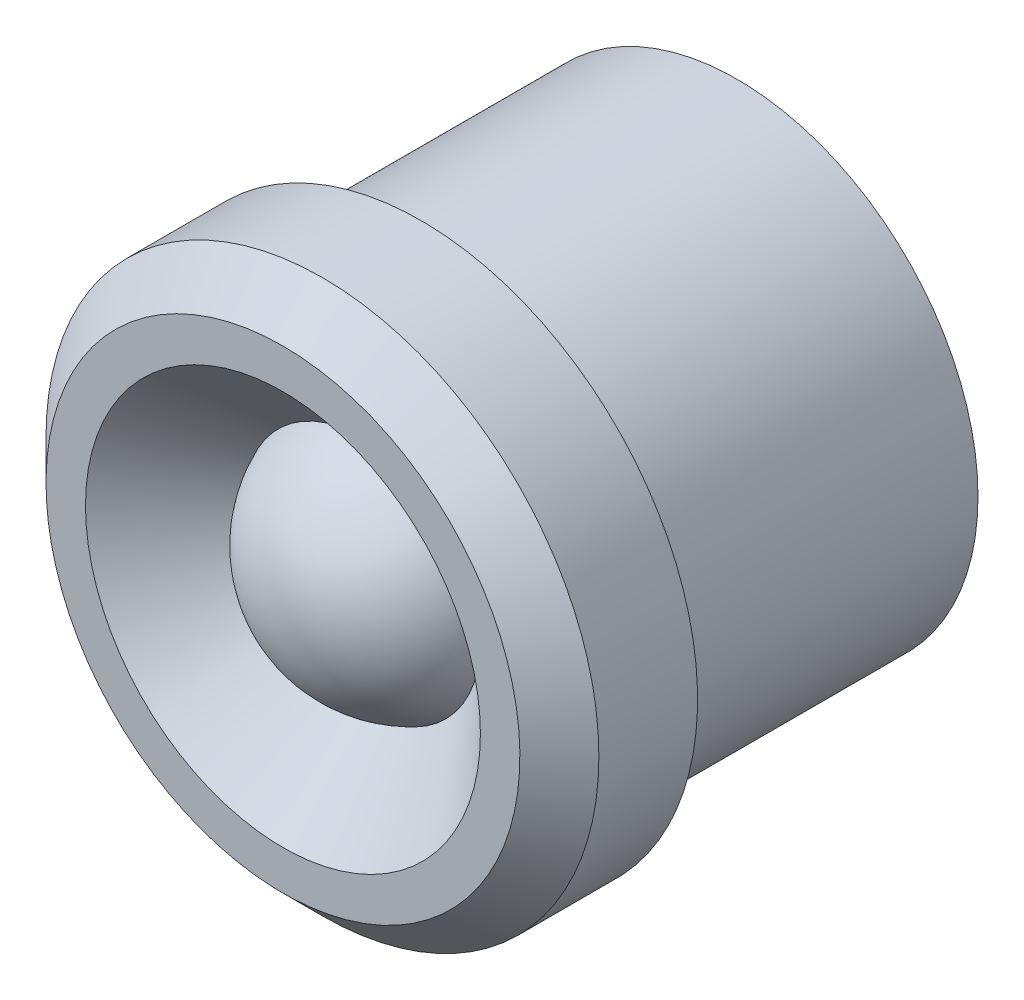
ISO-10303-21;
HEADER;
FILE_DESCRIPTION(('STEP AP214'),'2;1');
FILE_NAME('part.step','',(''),(''),'','','');
FILE_SCHEMA(('AUTOMOTIVE_DESIGN { 1 0 10303 214 1 1 1 1 }'));
ENDSEC;
DATA;
#1=APPLICATION_CONTEXT('core data for automotive mechanical design processes');
#2=APPLICATION_PROTOCOL_DEFINITION('international standard','automotive_design',2000,#1);
#3=PRODUCT_CONTEXT('',#1,'mechanical');
#4=PRODUCT('Part','Part','',(#3));
#5=PRODUCT_RELATED_PRODUCT_CATEGORY('part','',(#4));
#6=PRODUCT_DEFINITION_FORMATION('','',#4);
#7=PRODUCT_DEFINITION_CONTEXT('part definition',#1,'design');
#8=PRODUCT_DEFINITION('design','',#6,#7);
#9=PRODUCT_DEFINITION_SHAPE('','',#8);
#10=(LENGTH_UNIT() NAMED_UNIT(*) SI_UNIT(.MILLI.,.METRE.));
#11=(NAMED_UNIT(*) PLANE_ANGLE_UNIT() SI_UNIT($,.RADIAN.));
#12=(NAMED_UNIT(*) SI_UNIT($,.STERADIAN.) SOLID_ANGLE_UNIT());
#13=UNCERTAINTY_MEASURE_WITH_UNIT(LENGTH_MEASURE(1.E-05),#10,'distance_accuracy_value','');
#14=(GEOMETRIC_REPRESENTATION_CONTEXT(3) GLOBAL_UNCERTAINTY_ASSIGNED_CONTEXT((#13)) GLOBAL_UNIT_ASSIGNED_CONTEXT((#10,
#11,#12)) REPRESENTATION_CONTEXT('',''));
#15=CARTESIAN_POINT('',(0.,0.,0.));
#16=DIRECTION('',(0.,0.,1.));
#17=DIRECTION('',(1.,0.,0.));
#18=AXIS2_PLACEMENT_3D('',#15,#16,#17);
#19=CARTESIAN_POINT('',(0.,0.,0.));
#20=DIRECTION('',(0.,0.,1.));
#21=DIRECTION('',(1.,0.,0.));
#22=AXIS2_PLACEMENT_3D('',#19,#20,#21);
#23=PLANE('',#22);
#24=CARTESIAN_POINT('',(0.,0.,0.));
#25=DIRECTION('',(0.,0.,-1.));
#26=DIRECTION('',(-1.,0.,0.));
#27=AXIS2_PLACEMENT_3D('',#24,#25,#26);
#28=CIRCLE('',#27,3.);
#29=CARTESIAN_POINT('',(-3.,0.,0.));
#30=VERTEX_POINT('',#29);
#31=EDGE_CURVE('E19',#30,#30,#28,.F.);
#32=ORIENTED_EDGE('',*,*,#31,.F.);
#33=EDGE_LOOP('',(#32));
#34=FACE_BOUND('',#33,.T.);
#35=ADVANCED_FACE('F16',(#34),#23,.F.);
#36=CARTESIAN_POINT('',(0.,0.,0.));
#37=DIRECTION('',(0.,0.,-1.));
#38=DIRECTION('',(-1.,0.,0.));
#39=AXIS2_PLACEMENT_3D('',#36,#37,#38);
#40=CYLINDRICAL_SURFACE('',#39,3.);
#41=CARTESIAN_POINT('',(0.,0.,-8.));
#42=DIRECTION('',(0.,0.,-1.));
#43=DIRECTION('',(-1.,0.,0.));
#44=AXIS2_PLACEMENT_3D('',#41,#42,#43);
#45=CIRCLE('',#44,3.);
#46=CARTESIAN_POINT('',(-3.,0.,-8.));
#47=VERTEX_POINT('',#46);
#48=EDGE_CURVE('E56',#47,#47,#45,.F.);
#49=ORIENTED_EDGE('',*,*,#48,.F.);
#50=EDGE_LOOP('',(#49));
#51=FACE_BOUND('',#50,.T.);
#52=ORIENTED_EDGE('',*,*,#31,.T.);
#53=EDGE_LOOP('',(#52));
#54=FACE_BOUND('',#53,.T.);
#55=ADVANCED_FACE('F63',(#51,#54),#40,.F.);
#56=CARTESIAN_POINT('',(0.,0.,-8.));
#57=DIRECTION('',(0.,0.,-1.));
#58=DIRECTION('',(-1.,0.,0.));
#59=AXIS2_PLACEMENT_3D('',#56,#57,#58);
#60=PLANE('',#59);
#61=ORIENTED_EDGE('',*,*,#48,.T.);
#62=EDGE_LOOP('',(#61));
#63=FACE_BOUND('',#62,.T.);
#64=CARTESIAN_POINT('',(0.,0.,-8.));
#65=DIRECTION('',(0.,0.,1.));
#66=DIRECTION('',(1.,0.,0.));
#67=AXIS2_PLACEMENT_3D('',#64,#65,#66);
#68=CIRCLE('',#67,6.1);
#69=CARTESIAN_POINT('',(6.1,0.,-8.));
#70=VERTEX_POINT('',#69);
#71=EDGE_CURVE('E54',#70,#70,#68,.T.);
#72=ORIENTED_EDGE('',*,*,#71,.F.);
#73=EDGE_LOOP('',(#72));
#74=FACE_BOUND('',#73,.T.);
#75=ADVANCED_FACE('F70',(#63,#74),#60,.T.);
#76=CARTESIAN_POINT('',(0.,0.,0.));
#77=DIRECTION('',(0.,0.,1.));
#78=DIRECTION('',(1.,0.,0.));
#79=AXIS2_PLACEMENT_3D('',#76,#77,#78);
#80=CYLINDRICAL_SURFACE('',#79,6.1);
#81=CARTESIAN_POINT('',(0.,0.,0.));
#82=DIRECTION('',(0.,0.,1.));
#83=DIRECTION('',(1.,0.,0.));
#84=AXIS2_PLACEMENT_3D('',#81,#82,#83);
#85=CIRCLE('',#84,6.1);
#86=CARTESIAN_POINT('',(6.1,0.,0.));
#87=VERTEX_POINT('',#86);
#88=EDGE_CURVE('E51',#87,#87,#85,.T.);
#89=ORIENTED_EDGE('',*,*,#88,.F.);
#90=EDGE_LOOP('',(#89));
#91=FACE_BOUND('',#90,.T.);
#92=ORIENTED_EDGE('',*,*,#71,.T.);
#93=EDGE_LOOP('',(#92));
#94=FACE_BOUND('',#93,.T.);
#95=ADVANCED_FACE('F75',(#91,#94),#80,.T.);
#96=CARTESIAN_POINT('',(0.,0.,0.));
#97=DIRECTION('',(0.,0.,1.));
#98=DIRECTION('',(1.,0.,0.));
#99=AXIS2_PLACEMENT_3D('',#96,#97,#98);
#100=PLANE('',#99);
#101=ORIENTED_EDGE('',*,*,#88,.T.);
#102=EDGE_LOOP('',(#101));
#103=FACE_BOUND('',#102,.T.);
#104=CARTESIAN_POINT('',(0.,0.,0.));
#105=DIRECTION('',(0.,0.,-1.));
#106=DIRECTION('',(-1.,0.,0.));
#107=AXIS2_PLACEMENT_3D('',#104,#105,#106);
#108=CIRCLE('',#107,7.);
#109=CARTESIAN_POINT('',(-7.,0.,0.));
#110=VERTEX_POINT('',#109);
#111=EDGE_CURVE('E48',#110,#110,#108,.F.);
#112=ORIENTED_EDGE('',*,*,#111,.F.);
#113=EDGE_LOOP('',(#112));
#114=FACE_BOUND('',#113,.T.);
#115=ADVANCED_FACE('F80',(#103,#114),#100,.F.);
#116=CARTESIAN_POINT('',(0.,0.,0.));
#117=DIRECTION('',(0.,0.,-1.));
#118=DIRECTION('',(-1.,0.,0.));
#119=AXIS2_PLACEMENT_3D('',#116,#117,#118);
#120=CYLINDRICAL_SURFACE('',#119,7.);
#121=ORIENTED_EDGE('',*,*,#111,.T.);
#122=EDGE_LOOP('',(#121));
#123=FACE_BOUND('',#122,.T.);
#124=CARTESIAN_POINT('',(0.,0.,2.49999999999995));
#125=DIRECTION('',(0.,0.,-1.));
#126=DIRECTION('',(-1.,0.,0.));
#127=AXIS2_PLACEMENT_3D('',#124,#125,#126);
#128=CIRCLE('',#127,7.);
#129=CARTESIAN_POINT('',(-7.,0.,2.5));
#130=VERTEX_POINT('',#129);
#131=EDGE_CURVE('E44',#130,#130,#128,.F.);
#132=ORIENTED_EDGE('',*,*,#131,.F.);
#133=EDGE_LOOP('',(#132));
#134=FACE_BOUND('',#133,.T.);
#135=ADVANCED_FACE('F84',(#123,#134),#120,.T.);
#136=CARTESIAN_POINT('',(0.,0.,2.5));
#137=DIRECTION('',(0.,0.,-1.));
#138=DIRECTION('',(0.,1.,0.));
#139=AXIS2_PLACEMENT_3D('',#136,#137,#138);
#140=CONICAL_SURFACE('',#139,7.,0.785398163397448);
#141=ORIENTED_EDGE('',*,*,#131,.T.);
#142=EDGE_LOOP('',(#141));
#143=FACE_BOUND('',#142,.T.);
#144=CARTESIAN_POINT('',(0.,0.,3.50000000000006));
#145=DIRECTION('',(0.,0.,-1.));
#146=DIRECTION('',(0.,1.,0.));
#147=AXIS2_PLACEMENT_3D('',#144,#145,#146);
#148=CIRCLE('',#147,5.99999999999994);
#149=CARTESIAN_POINT('',(0.,5.99999999999994,3.50000000000006));
#150=VERTEX_POINT('',#149);
#151=EDGE_CURVE('E41',#150,#150,#148,.F.);
#152=ORIENTED_EDGE('',*,*,#151,.F.);
#153=EDGE_LOOP('',(#152));
#154=FACE_BOUND('',#153,.T.);
#155=ADVANCED_FACE('F88',(#143,#154),#140,.T.);
#156=CARTESIAN_POINT('',(0.,0.,3.5));
#157=DIRECTION('',(0.,0.,1.));
#158=DIRECTION('',(1.,0.,0.));
#159=AXIS2_PLACEMENT_3D('',#156,#157,#158);
#160=PLANE('',#159);
#161=CARTESIAN_POINT('',(0.,0.,3.49999999999995));
#162=DIRECTION('',(0.,0.,1.));
#163=DIRECTION('',(1.,0.,0.));
#164=AXIS2_PLACEMENT_3D('',#161,#162,#163);
#165=CIRCLE('',#164,4.99999999999995);
#166=CARTESIAN_POINT('',(4.99999999999995,0.,3.49999999999995));
#167=VERTEX_POINT('',#166);
#168=EDGE_CURVE('E23',#167,#167,#165,.T.);
#169=ORIENTED_EDGE('',*,*,#168,.F.);
#170=EDGE_LOOP('',(#169));
#171=FACE_BOUND('',#170,.T.);
#172=ORIENTED_EDGE('',*,*,#151,.T.);
#173=EDGE_LOOP('',(#172));
#174=FACE_BOUND('',#173,.T.);
#175=ADVANCED_FACE('F36',(#171,#174),#160,.T.);
#176=CARTESIAN_POINT('',(0.,0.,1.5));
#177=DIRECTION('',(0.,0.,1.));
#178=DIRECTION('',(1.,0.,0.));
#179=AXIS2_PLACEMENT_3D('',#176,#177,#178);
#180=CONICAL_SURFACE('',#179,3.,0.785398163397448);
#181=CARTESIAN_POINT('',(0.,0.,1.5));
#182=DIRECTION('',(0.,0.,1.));
#183=DIRECTION('',(1.,0.,0.));
#184=AXIS2_PLACEMENT_3D('',#181,#182,#183);
#185=CIRCLE('',#184,3.);
#186=CARTESIAN_POINT('',(3.,0.,1.5));
#187=VERTEX_POINT('',#186);
#188=EDGE_CURVE('E11',#187,#187,#185,.T.);
#189=ORIENTED_EDGE('',*,*,#188,.F.);
#190=EDGE_LOOP('',(#189));
#191=FACE_BOUND('',#190,.T.);
#192=ORIENTED_EDGE('',*,*,#168,.T.);
#193=EDGE_LOOP('',(#192));
#194=FACE_BOUND('',#193,.T.);
#195=ADVANCED_FACE('F30',(#191,#194),#180,.F.);
#196=CARTESIAN_POINT('',(0.,0.,3.5));
#197=CARTESIAN_POINT('',(6.50000000000004,0.,3.49999999999991));
#198=CARTESIAN_POINT('',(6.49999999999995,0.,-3.00000000000009));
#199=CARTESIAN_POINT('',(0.,0.,-3.));
#200=(BOUNDED_CURVE() B_SPLINE_CURVE(3,(#196,#197,#198,#199),.UNSPECIFIED.,.F.,
.F.) B_SPLINE_CURVE_WITH_KNOTS((4,4),(0.,1.),
.UNSPECIFIED.) CURVE() GEOMETRIC_REPRESENTATION_ITEM() RATIONAL_B_SPLINE_CURVE((1.,
0.333333333333334,0.333333333333334,1.)) REPRESENTATION_ITEM(''));
#201=CARTESIAN_POINT('',(0.,0.,0.25));
#202=DIRECTION('',(0.,0.,1.));
#203=AXIS1_PLACEMENT('',#201,#202);
#204=SURFACE_OF_REVOLUTION('',#200,#203);
#205=CARTESIAN_POINT('',(0.,0.,3.5));
#206=VERTEX_POINT('',#205);
#207=VERTEX_LOOP('',#206);
#208=FACE_BOUND('',#207,.T.);
#209=ORIENTED_EDGE('',*,*,#188,.T.);
#210=EDGE_LOOP('',(#209));
#211=FACE_BOUND('',#210,.T.);
#212=ADVANCED_FACE('F27',(#208,#211),#204,.F.);
#213=CLOSED_SHELL('',(#35,#55,#75,#95,#115,#135,#155,#175,#195,#212));
#214=MANIFOLD_SOLID_BREP('B1',#213);
#215=ADVANCED_BREP_SHAPE_REPRESENTATION('',(#18,#214),#14);
#216=SHAPE_DEFINITION_REPRESENTATION(#9,#215);
ENDSEC;
END-ISO-10303-21;
